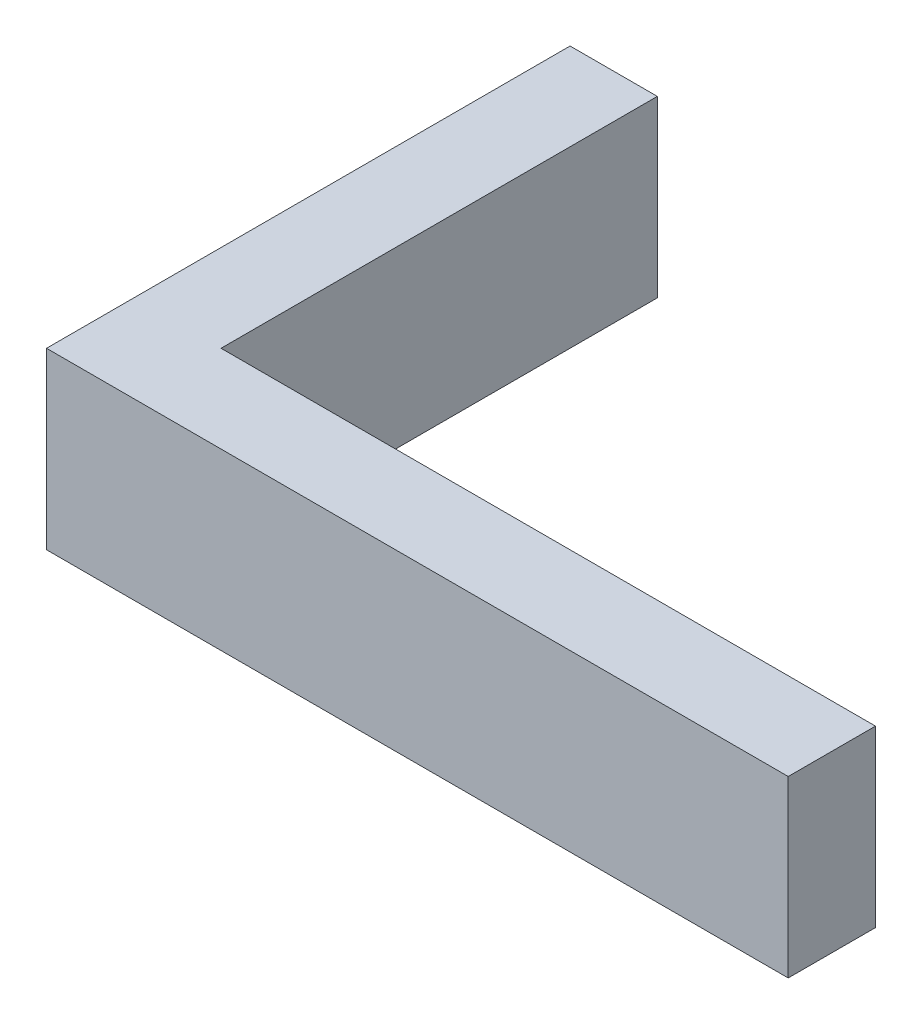
ISO-10303-21;
HEADER;
FILE_DESCRIPTION(('STEP AP214'),'2;1');
FILE_NAME('part.step','',(''),(''),'','','');
FILE_SCHEMA(('AUTOMOTIVE_DESIGN { 1 0 10303 214 1 1 1 1 }'));
ENDSEC;
DATA;
#1=APPLICATION_CONTEXT('core data for automotive mechanical design processes');
#2=APPLICATION_PROTOCOL_DEFINITION('international standard','automotive_design',2000,#1);
#3=PRODUCT_CONTEXT('',#1,'mechanical');
#4=PRODUCT('Part','Part','',(#3));
#5=PRODUCT_RELATED_PRODUCT_CATEGORY('part','',(#4));
#6=PRODUCT_DEFINITION_FORMATION('','',#4);
#7=PRODUCT_DEFINITION_CONTEXT('part definition',#1,'design');
#8=PRODUCT_DEFINITION('design','',#6,#7);
#9=PRODUCT_DEFINITION_SHAPE('','',#8);
#10=(LENGTH_UNIT() NAMED_UNIT(*) SI_UNIT(.MILLI.,.METRE.));
#11=(NAMED_UNIT(*) PLANE_ANGLE_UNIT() SI_UNIT($,.RADIAN.));
#12=(NAMED_UNIT(*) SI_UNIT($,.STERADIAN.) SOLID_ANGLE_UNIT());
#13=UNCERTAINTY_MEASURE_WITH_UNIT(LENGTH_MEASURE(1.E-05),#10,'distance_accuracy_value','');
#14=(GEOMETRIC_REPRESENTATION_CONTEXT(3) GLOBAL_UNCERTAINTY_ASSIGNED_CONTEXT((#13)) GLOBAL_UNIT_ASSIGNED_CONTEXT((#10,
#11,#12)) REPRESENTATION_CONTEXT('',''));
#15=CARTESIAN_POINT('',(0.,0.,0.));
#16=DIRECTION('',(0.,0.,1.));
#17=DIRECTION('',(1.,0.,0.));
#18=AXIS2_PLACEMENT_3D('',#15,#16,#17);
#19=CARTESIAN_POINT('',(-10.7317073170732,4.,-5.));
#20=DIRECTION('',(0.,0.,1.));
#21=DIRECTION('',(1.,0.,0.));
#22=AXIS2_PLACEMENT_3D('',#19,#20,#21);
#23=PLANE('',#22);
#24=DIRECTION('',(-1.,0.,0.));
#25=VECTOR('',#24,1.);
#26=CARTESIAN_POINT('',(-10.7317073170732,0.,-5.));
#27=LINE('',#26,#25);
#28=CARTESIAN_POINT('',(-10.7317073170732,0.,-5.));
#29=VERTEX_POINT('',#28);
#30=CARTESIAN_POINT('',(-12.7317073170732,0.,-5.));
#31=VERTEX_POINT('',#30);
#32=EDGE_CURVE('E117',#29,#31,#27,.T.);
#33=ORIENTED_EDGE('',*,*,#32,.T.);
#34=DIRECTION('',(0.,-1.,0.));
#35=VECTOR('',#34,1.);
#36=CARTESIAN_POINT('',(-12.7317073170732,4.,-5.));
#37=LINE('',#36,#35);
#38=CARTESIAN_POINT('',(-12.7317073170732,4.,-5.));
#39=VERTEX_POINT('',#38);
#40=EDGE_CURVE('E11',#39,#31,#37,.T.);
#41=ORIENTED_EDGE('',*,*,#40,.F.);
#42=DIRECTION('',(-1.,0.,0.));
#43=VECTOR('',#42,1.);
#44=CARTESIAN_POINT('',(-10.7317073170732,4.,-5.));
#45=LINE('',#44,#43);
#46=CARTESIAN_POINT('',(-10.7317073170732,4.,-5.));
#47=VERTEX_POINT('',#46);
#48=EDGE_CURVE('E127',#47,#39,#45,.T.);
#49=ORIENTED_EDGE('',*,*,#48,.F.);
#50=DIRECTION('',(0.,-1.,0.));
#51=VECTOR('',#50,1.);
#52=CARTESIAN_POINT('',(-10.7317073170732,4.,-5.));
#53=LINE('',#52,#51);
#54=EDGE_CURVE('E113',#47,#29,#53,.T.);
#55=ORIENTED_EDGE('',*,*,#54,.T.);
#56=EDGE_LOOP('',(#33,#41,#49,#55));
#57=FACE_BOUND('',#56,.T.);
#58=ADVANCED_FACE('F33',(#57),#23,.F.);
#59=CARTESIAN_POINT('',(-12.7317073170732,4.,-5.));
#60=DIRECTION('',(1.,0.,0.));
#61=DIRECTION('',(0.,0.,-1.));
#62=AXIS2_PLACEMENT_3D('',#59,#60,#61);
#63=PLANE('',#62);
#64=DIRECTION('',(0.,0.,1.));
#65=VECTOR('',#64,1.);
#66=CARTESIAN_POINT('',(-12.7317073170732,0.,-5.));
#67=LINE('',#66,#65);
#68=CARTESIAN_POINT('',(-12.7317073170732,0.,7.));
#69=VERTEX_POINT('',#68);
#70=EDGE_CURVE('E120',#31,#69,#67,.T.);
#71=ORIENTED_EDGE('',*,*,#70,.T.);
#72=DIRECTION('',(0.,-1.,0.));
#73=VECTOR('',#72,1.);
#74=CARTESIAN_POINT('',(-12.7317073170732,4.,7.));
#75=LINE('',#74,#73);
#76=CARTESIAN_POINT('',(-12.7317073170732,4.,7.));
#77=VERTEX_POINT('',#76);
#78=EDGE_CURVE('E41',#77,#69,#75,.T.);
#79=ORIENTED_EDGE('',*,*,#78,.F.);
#80=DIRECTION('',(0.,0.,1.));
#81=VECTOR('',#80,1.);
#82=CARTESIAN_POINT('',(-12.7317073170732,4.,-5.));
#83=LINE('',#82,#81);
#84=EDGE_CURVE('E86',#39,#77,#83,.T.);
#85=ORIENTED_EDGE('',*,*,#84,.F.);
#86=ORIENTED_EDGE('',*,*,#40,.T.);
#87=EDGE_LOOP('',(#71,#79,#85,#86));
#88=FACE_BOUND('',#87,.T.);
#89=ADVANCED_FACE('F151',(#88),#63,.F.);
#90=CARTESIAN_POINT('',(-12.7317073170732,4.,7.));
#91=DIRECTION('',(0.,0.,-1.));
#92=DIRECTION('',(-1.,0.,0.));
#93=AXIS2_PLACEMENT_3D('',#90,#91,#92);
#94=PLANE('',#93);
#95=DIRECTION('',(1.,0.,0.));
#96=VECTOR('',#95,1.);
#97=CARTESIAN_POINT('',(-12.7317073170732,0.,7.));
#98=LINE('',#97,#96);
#99=CARTESIAN_POINT('',(4.26829268292683,0.,7.));
#100=VERTEX_POINT('',#99);
#101=EDGE_CURVE('E122',#69,#100,#98,.T.);
#102=ORIENTED_EDGE('',*,*,#101,.T.);
#103=DIRECTION('',(0.,-1.,0.));
#104=VECTOR('',#103,1.);
#105=CARTESIAN_POINT('',(4.26829268292683,4.,7.));
#106=LINE('',#105,#104);
#107=CARTESIAN_POINT('',(4.26829268292683,4.,7.));
#108=VERTEX_POINT('',#107);
#109=EDGE_CURVE('E108',#108,#100,#106,.T.);
#110=ORIENTED_EDGE('',*,*,#109,.F.);
#111=DIRECTION('',(1.,0.,0.));
#112=VECTOR('',#111,1.);
#113=CARTESIAN_POINT('',(-12.7317073170732,4.,7.));
#114=LINE('',#113,#112);
#115=EDGE_CURVE('E99',#77,#108,#114,.T.);
#116=ORIENTED_EDGE('',*,*,#115,.F.);
#117=ORIENTED_EDGE('',*,*,#78,.T.);
#118=EDGE_LOOP('',(#102,#110,#116,#117));
#119=FACE_BOUND('',#118,.T.);
#120=ADVANCED_FACE('F133',(#119),#94,.F.);
#121=CARTESIAN_POINT('',(4.26829268292683,4.,7.));
#122=DIRECTION('',(-1.,0.,0.));
#123=DIRECTION('',(0.,0.,1.));
#124=AXIS2_PLACEMENT_3D('',#121,#122,#123);
#125=PLANE('',#124);
#126=DIRECTION('',(0.,0.,-1.));
#127=VECTOR('',#126,1.);
#128=CARTESIAN_POINT('',(4.26829268292683,0.,7.));
#129=LINE('',#128,#127);
#130=CARTESIAN_POINT('',(4.26829268292683,0.,5.));
#131=VERTEX_POINT('',#130);
#132=EDGE_CURVE('E107',#100,#131,#129,.T.);
#133=ORIENTED_EDGE('',*,*,#132,.T.);
#134=DIRECTION('',(0.,-1.,0.));
#135=VECTOR('',#134,1.);
#136=CARTESIAN_POINT('',(4.26829268292683,4.,5.));
#137=LINE('',#136,#135);
#138=CARTESIAN_POINT('',(4.26829268292683,4.,5.));
#139=VERTEX_POINT('',#138);
#140=EDGE_CURVE('E104',#139,#131,#137,.T.);
#141=ORIENTED_EDGE('',*,*,#140,.F.);
#142=DIRECTION('',(0.,0.,-1.));
#143=VECTOR('',#142,1.);
#144=CARTESIAN_POINT('',(4.26829268292683,4.,7.));
#145=LINE('',#144,#143);
#146=EDGE_CURVE('E93',#108,#139,#145,.T.);
#147=ORIENTED_EDGE('',*,*,#146,.F.);
#148=ORIENTED_EDGE('',*,*,#109,.T.);
#149=EDGE_LOOP('',(#133,#141,#147,#148));
#150=FACE_BOUND('',#149,.T.);
#151=ADVANCED_FACE('F105',(#150),#125,.F.);
#152=CARTESIAN_POINT('',(4.26829268292683,4.,5.));
#153=DIRECTION('',(0.,0.,1.));
#154=DIRECTION('',(1.,0.,0.));
#155=AXIS2_PLACEMENT_3D('',#152,#153,#154);
#156=PLANE('',#155);
#157=DIRECTION('',(-1.,0.,0.));
#158=VECTOR('',#157,1.);
#159=CARTESIAN_POINT('',(4.26829268292683,0.,5.));
#160=LINE('',#159,#158);
#161=CARTESIAN_POINT('',(-10.7317073170732,0.,5.));
#162=VERTEX_POINT('',#161);
#163=EDGE_CURVE('E72',#131,#162,#160,.T.);
#164=ORIENTED_EDGE('',*,*,#163,.T.);
#165=DIRECTION('',(0.,-1.,0.));
#166=VECTOR('',#165,1.);
#167=CARTESIAN_POINT('',(-10.7317073170732,4.,5.));
#168=LINE('',#167,#166);
#169=CARTESIAN_POINT('',(-10.7317073170732,4.,5.));
#170=VERTEX_POINT('',#169);
#171=EDGE_CURVE('E109',#170,#162,#168,.T.);
#172=ORIENTED_EDGE('',*,*,#171,.F.);
#173=DIRECTION('',(-1.,0.,0.));
#174=VECTOR('',#173,1.);
#175=CARTESIAN_POINT('',(4.26829268292683,4.,5.));
#176=LINE('',#175,#174);
#177=EDGE_CURVE('E97',#139,#170,#176,.T.);
#178=ORIENTED_EDGE('',*,*,#177,.F.);
#179=ORIENTED_EDGE('',*,*,#140,.T.);
#180=EDGE_LOOP('',(#164,#172,#178,#179));
#181=FACE_BOUND('',#180,.T.);
#182=ADVANCED_FACE('F111',(#181),#156,.F.);
#183=CARTESIAN_POINT('',(-10.7317073170732,4.,5.));
#184=DIRECTION('',(-1.,0.,0.));
#185=DIRECTION('',(0.,0.,1.));
#186=AXIS2_PLACEMENT_3D('',#183,#184,#185);
#187=PLANE('',#186);
#188=DIRECTION('',(0.,0.,-1.));
#189=VECTOR('',#188,1.);
#190=CARTESIAN_POINT('',(-10.7317073170732,0.,5.));
#191=LINE('',#190,#189);
#192=EDGE_CURVE('E78',#162,#29,#191,.T.);
#193=ORIENTED_EDGE('',*,*,#192,.T.);
#194=ORIENTED_EDGE('',*,*,#54,.F.);
#195=DIRECTION('',(0.,0.,-1.));
#196=VECTOR('',#195,1.);
#197=CARTESIAN_POINT('',(-10.7317073170732,4.,5.));
#198=LINE('',#197,#196);
#199=EDGE_CURVE('E49',#170,#47,#198,.T.);
#200=ORIENTED_EDGE('',*,*,#199,.F.);
#201=ORIENTED_EDGE('',*,*,#171,.T.);
#202=EDGE_LOOP('',(#193,#194,#200,#201));
#203=FACE_BOUND('',#202,.T.);
#204=ADVANCED_FACE('F140',(#203),#187,.F.);
#205=CARTESIAN_POINT('',(0.,4.,0.));
#206=DIRECTION('',(0.,1.,0.));
#207=DIRECTION('',(0.,0.,1.));
#208=AXIS2_PLACEMENT_3D('',#205,#206,#207);
#209=PLANE('',#208);
#210=ORIENTED_EDGE('',*,*,#48,.T.);
#211=ORIENTED_EDGE('',*,*,#84,.T.);
#212=ORIENTED_EDGE('',*,*,#115,.T.);
#213=ORIENTED_EDGE('',*,*,#146,.T.);
#214=ORIENTED_EDGE('',*,*,#177,.T.);
#215=ORIENTED_EDGE('',*,*,#199,.T.);
#216=EDGE_LOOP('',(#210,#211,#212,#213,#214,#215));
#217=FACE_BOUND('',#216,.T.);
#218=ADVANCED_FACE('F95',(#217),#209,.T.);
#219=CARTESIAN_POINT('',(0.,0.,0.));
#220=DIRECTION('',(0.,1.,0.));
#221=DIRECTION('',(0.,0.,1.));
#222=AXIS2_PLACEMENT_3D('',#219,#220,#221);
#223=PLANE('',#222);
#224=ORIENTED_EDGE('',*,*,#32,.F.);
#225=ORIENTED_EDGE('',*,*,#192,.F.);
#226=ORIENTED_EDGE('',*,*,#163,.F.);
#227=ORIENTED_EDGE('',*,*,#132,.F.);
#228=ORIENTED_EDGE('',*,*,#101,.F.);
#229=ORIENTED_EDGE('',*,*,#70,.F.);
#230=EDGE_LOOP('',(#224,#225,#226,#227,#228,#229));
#231=FACE_BOUND('',#230,.T.);
#232=ADVANCED_FACE('F136',(#231),#223,.F.);
#233=CLOSED_SHELL('',(#58,#89,#120,#151,#182,#204,#218,#232));
#234=MANIFOLD_SOLID_BREP('B2',#233);
#235=ADVANCED_BREP_SHAPE_REPRESENTATION('',(#18,#234),#14);
#236=SHAPE_DEFINITION_REPRESENTATION(#9,#235);
ENDSEC;
END-ISO-10303-21;
